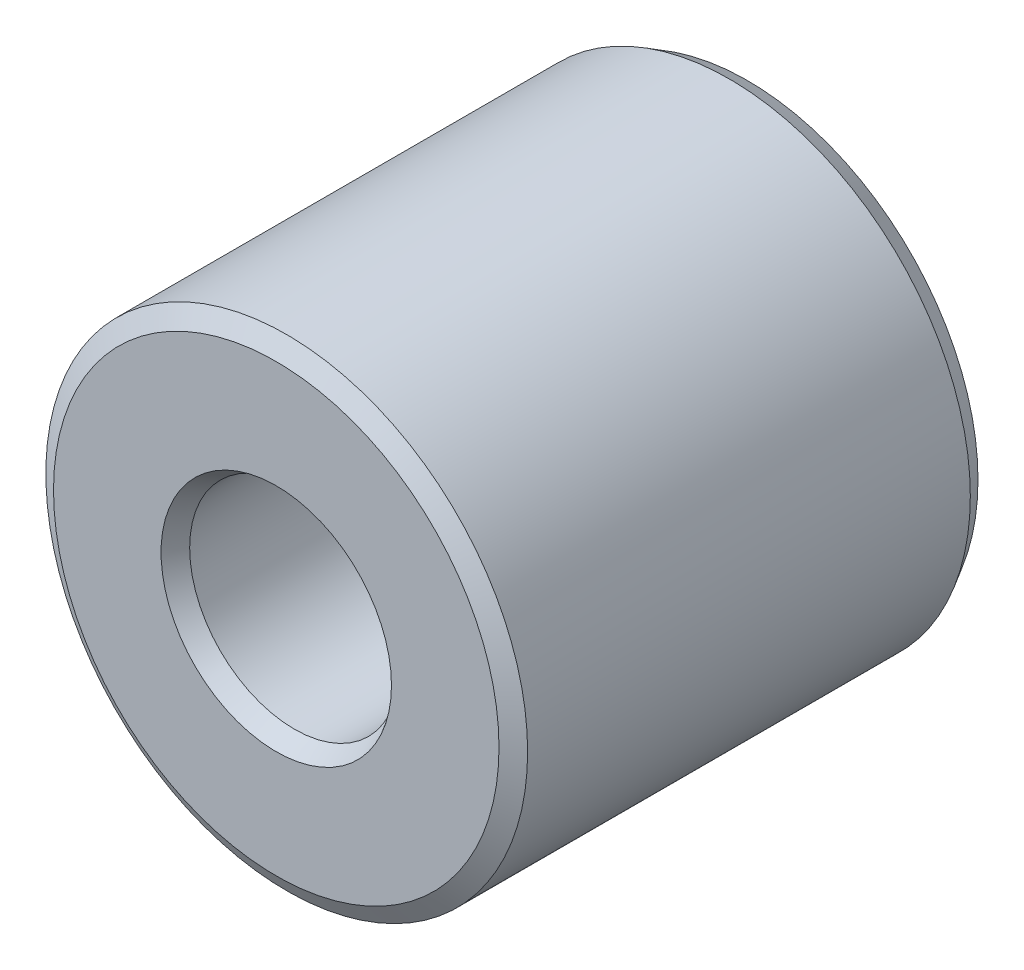
ISO-10303-21;
HEADER;
FILE_DESCRIPTION(('STEP AP214'),'2;1');
FILE_NAME('part.step','',(''),(''),'','','');
FILE_SCHEMA(('AUTOMOTIVE_DESIGN { 1 0 10303 214 1 1 1 1 }'));
ENDSEC;
DATA;
#1=APPLICATION_CONTEXT('core data for automotive mechanical design processes');
#2=APPLICATION_PROTOCOL_DEFINITION('international standard','automotive_design',2000,#1);
#3=PRODUCT_CONTEXT('',#1,'mechanical');
#4=PRODUCT('Part','Part','',(#3));
#5=PRODUCT_RELATED_PRODUCT_CATEGORY('part','',(#4));
#6=PRODUCT_DEFINITION_FORMATION('','',#4);
#7=PRODUCT_DEFINITION_CONTEXT('part definition',#1,'design');
#8=PRODUCT_DEFINITION('design','',#6,#7);
#9=PRODUCT_DEFINITION_SHAPE('','',#8);
#10=(LENGTH_UNIT() NAMED_UNIT(*) SI_UNIT(.MILLI.,.METRE.));
#11=(NAMED_UNIT(*) PLANE_ANGLE_UNIT() SI_UNIT($,.RADIAN.));
#12=(NAMED_UNIT(*) SI_UNIT($,.STERADIAN.) SOLID_ANGLE_UNIT());
#13=UNCERTAINTY_MEASURE_WITH_UNIT(LENGTH_MEASURE(1.E-05),#10,'distance_accuracy_value','');
#14=(GEOMETRIC_REPRESENTATION_CONTEXT(3) GLOBAL_UNCERTAINTY_ASSIGNED_CONTEXT((#13)) GLOBAL_UNIT_ASSIGNED_CONTEXT((#10,
#11,#12)) REPRESENTATION_CONTEXT('',''));
#15=CARTESIAN_POINT('',(0.,0.,0.));
#16=DIRECTION('',(0.,0.,1.));
#17=DIRECTION('',(1.,0.,0.));
#18=AXIS2_PLACEMENT_3D('',#15,#16,#17);
#19=CARTESIAN_POINT('',(0.,0.,4.5));
#20=DIRECTION('',(0.,0.,1.));
#21=DIRECTION('',(1.,0.,0.));
#22=AXIS2_PLACEMENT_3D('',#19,#20,#21);
#23=PLANE('',#22);
#24=CARTESIAN_POINT('',(0.,0.,4.5));
#25=DIRECTION('',(0.,0.,1.));
#26=DIRECTION('',(1.,0.,0.));
#27=AXIS2_PLACEMENT_3D('',#24,#25,#26);
#28=CIRCLE('',#27,2.12679491924311);
#29=CARTESIAN_POINT('',(2.12679491924311,0.,4.5));
#30=VERTEX_POINT('',#29);
#31=EDGE_CURVE('E41',#30,#30,#28,.T.);
#32=ORIENTED_EDGE('',*,*,#31,.T.);
#33=EDGE_LOOP('',(#32));
#34=FACE_BOUND('',#33,.T.);
#35=CARTESIAN_POINT('',(0.,0.,4.5));
#36=DIRECTION('',(0.,0.,1.));
#37=DIRECTION('',(1.,0.,0.));
#38=AXIS2_PLACEMENT_3D('',#35,#36,#37);
#39=CIRCLE('',#38,1.1);
#40=CARTESIAN_POINT('',(1.1,0.,4.5));
#41=VERTEX_POINT('',#40);
#42=EDGE_CURVE('E45',#41,#41,#39,.F.);
#43=ORIENTED_EDGE('',*,*,#42,.T.);
#44=EDGE_LOOP('',(#43));
#45=FACE_BOUND('',#44,.T.);
#46=ADVANCED_FACE('F30',(#34,#45),#23,.T.);
#47=CARTESIAN_POINT('',(0.,0.,0.));
#48=DIRECTION('',(0.,0.,1.));
#49=DIRECTION('',(1.,0.,0.));
#50=AXIS2_PLACEMENT_3D('',#47,#48,#49);
#51=PLANE('',#50);
#52=CARTESIAN_POINT('',(0.,0.,0.));
#53=DIRECTION('',(0.,0.,1.));
#54=DIRECTION('',(1.,0.,0.));
#55=AXIS2_PLACEMENT_3D('',#52,#53,#54);
#56=CIRCLE('',#55,2.2);
#57=CARTESIAN_POINT('',(2.2,0.,0.));
#58=VERTEX_POINT('',#57);
#59=EDGE_CURVE('E50',#58,#58,#56,.F.);
#60=ORIENTED_EDGE('',*,*,#59,.T.);
#61=EDGE_LOOP('',(#60));
#62=FACE_BOUND('',#61,.T.);
#63=CARTESIAN_POINT('',(0.,0.,0.));
#64=DIRECTION('',(0.,0.,1.));
#65=DIRECTION('',(1.,0.,0.));
#66=AXIS2_PLACEMENT_3D('',#63,#64,#65);
#67=CIRCLE('',#66,1.17320508075689);
#68=CARTESIAN_POINT('',(1.17320508075689,0.,0.));
#69=VERTEX_POINT('',#68);
#70=EDGE_CURVE('E53',#69,#69,#67,.T.);
#71=ORIENTED_EDGE('',*,*,#70,.T.);
#72=EDGE_LOOP('',(#71));
#73=FACE_BOUND('',#72,.T.);
#74=ADVANCED_FACE('F75',(#62,#73),#51,.F.);
#75=CARTESIAN_POINT('',(0.,0.,4.5));
#76=DIRECTION('',(0.,0.,-1.));
#77=DIRECTION('',(-1.,0.,0.));
#78=AXIS2_PLACEMENT_3D('',#75,#76,#77);
#79=CYLINDRICAL_SURFACE('',#78,2.3);
#80=CARTESIAN_POINT('',(0.,0.,0.173205080756886));
#81=DIRECTION('',(0.,0.,1.));
#82=DIRECTION('',(1.,0.,0.));
#83=AXIS2_PLACEMENT_3D('',#80,#81,#82);
#84=CIRCLE('',#83,2.3);
#85=CARTESIAN_POINT('',(2.3,0.,0.173205080756886));
#86=VERTEX_POINT('',#85);
#87=EDGE_CURVE('E56',#86,#86,#84,.T.);
#88=ORIENTED_EDGE('',*,*,#87,.T.);
#89=EDGE_LOOP('',(#88));
#90=FACE_BOUND('',#89,.T.);
#91=CARTESIAN_POINT('',(0.,0.,4.4));
#92=DIRECTION('',(0.,0.,1.));
#93=DIRECTION('',(1.,0.,0.));
#94=AXIS2_PLACEMENT_3D('',#91,#92,#93);
#95=CIRCLE('',#94,2.3);
#96=CARTESIAN_POINT('',(2.3,0.,4.4));
#97=VERTEX_POINT('',#96);
#98=EDGE_CURVE('E59',#97,#97,#95,.F.);
#99=ORIENTED_EDGE('',*,*,#98,.T.);
#100=EDGE_LOOP('',(#99));
#101=FACE_BOUND('',#100,.T.);
#102=ADVANCED_FACE('F63',(#90,#101),#79,.T.);
#103=CARTESIAN_POINT('',(0.,0.,4.5));
#104=DIRECTION('',(0.,0.,-1.));
#105=DIRECTION('',(-1.,0.,0.));
#106=AXIS2_PLACEMENT_3D('',#103,#104,#105);
#107=CYLINDRICAL_SURFACE('',#106,1.);
#108=CARTESIAN_POINT('',(0.,0.,0.1));
#109=DIRECTION('',(0.,0.,1.));
#110=DIRECTION('',(1.,0.,0.));
#111=AXIS2_PLACEMENT_3D('',#108,#109,#110);
#112=CIRCLE('',#111,1.);
#113=CARTESIAN_POINT('',(1.,0.,0.1));
#114=VERTEX_POINT('',#113);
#115=EDGE_CURVE('E10',#114,#114,#112,.F.);
#116=ORIENTED_EDGE('',*,*,#115,.T.);
#117=EDGE_LOOP('',(#116));
#118=FACE_BOUND('',#117,.T.);
#119=CARTESIAN_POINT('',(0.,0.,4.32679491924311));
#120=DIRECTION('',(0.,0.,1.));
#121=DIRECTION('',(1.,0.,0.));
#122=AXIS2_PLACEMENT_3D('',#119,#120,#121);
#123=CIRCLE('',#122,1.);
#124=CARTESIAN_POINT('',(1.,0.,4.32679491924311));
#125=VERTEX_POINT('',#124);
#126=EDGE_CURVE('E37',#125,#125,#123,.T.);
#127=ORIENTED_EDGE('',*,*,#126,.T.);
#128=EDGE_LOOP('',(#127));
#129=FACE_BOUND('',#128,.T.);
#130=ADVANCED_FACE('F91',(#118,#129),#107,.F.);
#131=CARTESIAN_POINT('',(0.,0.,0.173205080756886));
#132=DIRECTION('',(0.,0.,1.));
#133=DIRECTION('',(1.,0.,0.));
#134=AXIS2_PLACEMENT_3D('',#131,#132,#133);
#135=CONICAL_SURFACE('',#134,2.3,0.5235987755983);
#136=ORIENTED_EDGE('',*,*,#59,.F.);
#137=EDGE_LOOP('',(#136));
#138=FACE_BOUND('',#137,.T.);
#139=ORIENTED_EDGE('',*,*,#87,.F.);
#140=EDGE_LOOP('',(#139));
#141=FACE_BOUND('',#140,.T.);
#142=ADVANCED_FACE('F69',(#138,#141),#135,.T.);
#143=CARTESIAN_POINT('',(0.,0.,4.5));
#144=DIRECTION('',(0.,0.,-1.));
#145=DIRECTION('',(-1.,0.,0.));
#146=AXIS2_PLACEMENT_3D('',#143,#144,#145);
#147=CONICAL_SURFACE('',#146,2.12679491924311,1.0471975511966);
#148=ORIENTED_EDGE('',*,*,#98,.F.);
#149=EDGE_LOOP('',(#148));
#150=FACE_BOUND('',#149,.T.);
#151=ORIENTED_EDGE('',*,*,#31,.F.);
#152=EDGE_LOOP('',(#151));
#153=FACE_BOUND('',#152,.T.);
#154=ADVANCED_FACE('F65',(#150,#153),#147,.T.);
#155=CARTESIAN_POINT('',(0.,0.,0.));
#156=DIRECTION('',(0.,0.,-1.));
#157=DIRECTION('',(-1.,0.,0.));
#158=AXIS2_PLACEMENT_3D('',#155,#156,#157);
#159=CONICAL_SURFACE('',#158,1.17320508075689,1.0471975511966);
#160=ORIENTED_EDGE('',*,*,#115,.F.);
#161=EDGE_LOOP('',(#160));
#162=FACE_BOUND('',#161,.T.);
#163=ORIENTED_EDGE('',*,*,#70,.F.);
#164=EDGE_LOOP('',(#163));
#165=FACE_BOUND('',#164,.T.);
#166=ADVANCED_FACE('F68',(#162,#165),#159,.F.);
#167=CARTESIAN_POINT('',(0.,0.,4.32679491924311));
#168=DIRECTION('',(0.,0.,1.));
#169=DIRECTION('',(1.,0.,0.));
#170=AXIS2_PLACEMENT_3D('',#167,#168,#169);
#171=CONICAL_SURFACE('',#170,1.,0.523598775598298);
#172=ORIENTED_EDGE('',*,*,#42,.F.);
#173=EDGE_LOOP('',(#172));
#174=FACE_BOUND('',#173,.T.);
#175=ORIENTED_EDGE('',*,*,#126,.F.);
#176=EDGE_LOOP('',(#175));
#177=FACE_BOUND('',#176,.T.);
#178=ADVANCED_FACE('F32',(#174,#177),#171,.F.);
#179=CLOSED_SHELL('',(#46,#74,#102,#130,#142,#154,#166,#178));
#180=MANIFOLD_SOLID_BREP('B2',#179);
#181=ADVANCED_BREP_SHAPE_REPRESENTATION('',(#18,#180),#14);
#182=SHAPE_DEFINITION_REPRESENTATION(#9,#181);
ENDSEC;
END-ISO-10303-21;
